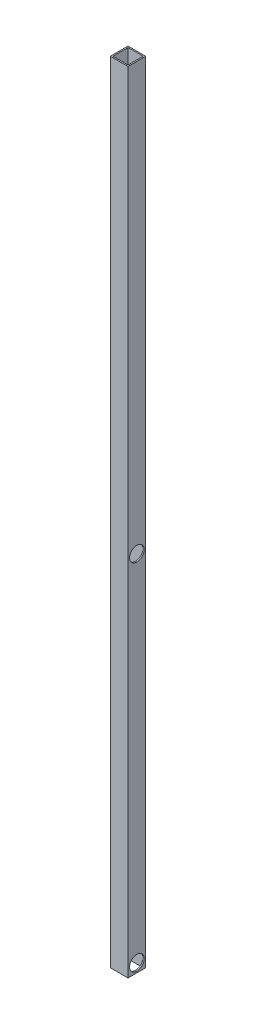
ISO-10303-21;
HEADER;
FILE_DESCRIPTION(('STEP AP214'),'2;1');
FILE_NAME('part.step','',(''),(''),'','','');
FILE_SCHEMA(('AUTOMOTIVE_DESIGN { 1 0 10303 214 1 1 1 1 }'));
ENDSEC;
DATA;
#1=APPLICATION_CONTEXT('core data for automotive mechanical design processes');
#2=APPLICATION_PROTOCOL_DEFINITION('international standard','automotive_design',2000,#1);
#3=PRODUCT_CONTEXT('',#1,'mechanical');
#4=PRODUCT('Part','Part','',(#3));
#5=PRODUCT_RELATED_PRODUCT_CATEGORY('part','',(#4));
#6=PRODUCT_DEFINITION_FORMATION('','',#4);
#7=PRODUCT_DEFINITION_CONTEXT('part definition',#1,'design');
#8=PRODUCT_DEFINITION('design','',#6,#7);
#9=PRODUCT_DEFINITION_SHAPE('','',#8);
#10=(LENGTH_UNIT() NAMED_UNIT(*) SI_UNIT(.MILLI.,.METRE.));
#11=(NAMED_UNIT(*) PLANE_ANGLE_UNIT() SI_UNIT($,.RADIAN.));
#12=(NAMED_UNIT(*) SI_UNIT($,.STERADIAN.) SOLID_ANGLE_UNIT());
#13=UNCERTAINTY_MEASURE_WITH_UNIT(LENGTH_MEASURE(1.E-05),#10,'distance_accuracy_value','');
#14=(GEOMETRIC_REPRESENTATION_CONTEXT(3) GLOBAL_UNCERTAINTY_ASSIGNED_CONTEXT((#13)) GLOBAL_UNIT_ASSIGNED_CONTEXT((#10,
#11,#12)) REPRESENTATION_CONTEXT('',''));
#15=CARTESIAN_POINT('',(0.,0.,0.));
#16=DIRECTION('',(0.,0.,1.));
#17=DIRECTION('',(1.,0.,0.));
#18=AXIS2_PLACEMENT_3D('',#15,#16,#17);
#19=CARTESIAN_POINT('',(44.45,22.225,-22.225));
#20=DIRECTION('',(1.,0.,0.));
#21=DIRECTION('',(0.,0.,-1.));
#22=AXIS2_PLACEMENT_3D('',#19,#20,#21);
#23=CYLINDRICAL_SURFACE('',#22,18.25625);
#24=CARTESIAN_POINT('',(41.275,22.225,-22.225));
#25=DIRECTION('',(1.,0.,0.));
#26=DIRECTION('',(0.,0.,-1.));
#27=AXIS2_PLACEMENT_3D('',#24,#25,#26);
#28=CIRCLE('',#27,18.25625);
#29=CARTESIAN_POINT('',(41.275,22.225,-40.48125));
#30=VERTEX_POINT('',#29);
#31=EDGE_CURVE('E20',#30,#30,#28,.T.);
#32=ORIENTED_EDGE('',*,*,#31,.F.);
#33=EDGE_LOOP('',(#32));
#34=FACE_BOUND('',#33,.T.);
#35=CARTESIAN_POINT('',(44.45,22.225,-22.225));
#36=DIRECTION('',(1.,0.,0.));
#37=DIRECTION('',(0.,0.,-1.));
#38=AXIS2_PLACEMENT_3D('',#35,#36,#37);
#39=CIRCLE('',#38,18.25625);
#40=CARTESIAN_POINT('',(44.45,22.225,-40.48125));
#41=VERTEX_POINT('',#40);
#42=EDGE_CURVE('E120',#41,#41,#39,.F.);
#43=ORIENTED_EDGE('',*,*,#42,.F.);
#44=EDGE_LOOP('',(#43));
#45=FACE_BOUND('',#44,.T.);
#46=ADVANCED_FACE('F17',(#34,#45),#23,.F.);
#47=CARTESIAN_POINT('',(44.45,911.225,-22.225));
#48=DIRECTION('',(1.,0.,0.));
#49=DIRECTION('',(0.,0.,-1.));
#50=AXIS2_PLACEMENT_3D('',#47,#48,#49);
#51=CYLINDRICAL_SURFACE('',#50,18.25625);
#52=CARTESIAN_POINT('',(41.275,911.225,-22.225));
#53=DIRECTION('',(1.,0.,0.));
#54=DIRECTION('',(0.,0.,-1.));
#55=AXIS2_PLACEMENT_3D('',#52,#53,#54);
#56=CIRCLE('',#55,18.25625);
#57=CARTESIAN_POINT('',(41.275,911.225,-40.48125));
#58=VERTEX_POINT('',#57);
#59=EDGE_CURVE('E126',#58,#58,#56,.T.);
#60=ORIENTED_EDGE('',*,*,#59,.F.);
#61=EDGE_LOOP('',(#60));
#62=FACE_BOUND('',#61,.T.);
#63=CARTESIAN_POINT('',(44.45,911.225,-22.225));
#64=DIRECTION('',(1.,0.,0.));
#65=DIRECTION('',(0.,0.,-1.));
#66=AXIS2_PLACEMENT_3D('',#63,#64,#65);
#67=CIRCLE('',#66,18.25625);
#68=CARTESIAN_POINT('',(44.45,911.225,-40.48125));
#69=VERTEX_POINT('',#68);
#70=EDGE_CURVE('E116',#69,#69,#67,.F.);
#71=ORIENTED_EDGE('',*,*,#70,.F.);
#72=EDGE_LOOP('',(#71));
#73=FACE_BOUND('',#72,.T.);
#74=ADVANCED_FACE('F153',(#62,#73),#51,.F.);
#75=CARTESIAN_POINT('',(44.45,911.225,-22.225));
#76=DIRECTION('',(1.,0.,0.));
#77=DIRECTION('',(0.,0.,-1.));
#78=AXIS2_PLACEMENT_3D('',#75,#76,#77);
#79=CYLINDRICAL_SURFACE('',#78,12.7);
#80=CARTESIAN_POINT('',(3.175,911.225,-22.225));
#81=DIRECTION('',(1.,0.,0.));
#82=DIRECTION('',(0.,0.,-1.));
#83=AXIS2_PLACEMENT_3D('',#80,#81,#82);
#84=CIRCLE('',#83,12.7);
#85=CARTESIAN_POINT('',(3.175,911.225,-34.925));
#86=VERTEX_POINT('',#85);
#87=EDGE_CURVE('E91',#86,#86,#84,.F.);
#88=ORIENTED_EDGE('',*,*,#87,.F.);
#89=EDGE_LOOP('',(#88));
#90=FACE_BOUND('',#89,.T.);
#91=CARTESIAN_POINT('',(0.,911.225,-22.225));
#92=DIRECTION('',(1.,0.,0.));
#93=DIRECTION('',(0.,0.,-1.));
#94=AXIS2_PLACEMENT_3D('',#91,#92,#93);
#95=CIRCLE('',#94,12.7);
#96=CARTESIAN_POINT('',(0.,911.225,-34.925));
#97=VERTEX_POINT('',#96);
#98=EDGE_CURVE('E131',#97,#97,#95,.T.);
#99=ORIENTED_EDGE('',*,*,#98,.F.);
#100=EDGE_LOOP('',(#99));
#101=FACE_BOUND('',#100,.T.);
#102=ADVANCED_FACE('F229',(#90,#101),#79,.F.);
#103=CARTESIAN_POINT('',(44.45,22.225,-22.225));
#104=DIRECTION('',(1.,0.,0.));
#105=DIRECTION('',(0.,0.,-1.));
#106=AXIS2_PLACEMENT_3D('',#103,#104,#105);
#107=CYLINDRICAL_SURFACE('',#106,12.7);
#108=CARTESIAN_POINT('',(3.175,22.225,-22.225));
#109=DIRECTION('',(1.,0.,0.));
#110=DIRECTION('',(0.,0.,-1.));
#111=AXIS2_PLACEMENT_3D('',#108,#109,#110);
#112=CIRCLE('',#111,12.7);
#113=CARTESIAN_POINT('',(3.175,22.225,-34.925));
#114=VERTEX_POINT('',#113);
#115=EDGE_CURVE('E123',#114,#114,#112,.F.);
#116=ORIENTED_EDGE('',*,*,#115,.F.);
#117=EDGE_LOOP('',(#116));
#118=FACE_BOUND('',#117,.T.);
#119=CARTESIAN_POINT('',(0.,22.225,-22.225));
#120=DIRECTION('',(1.,0.,0.));
#121=DIRECTION('',(0.,0.,-1.));
#122=AXIS2_PLACEMENT_3D('',#119,#120,#121);
#123=CIRCLE('',#122,12.7);
#124=CARTESIAN_POINT('',(0.,22.225,-34.925));
#125=VERTEX_POINT('',#124);
#126=EDGE_CURVE('E127',#125,#125,#123,.T.);
#127=ORIENTED_EDGE('',*,*,#126,.F.);
#128=EDGE_LOOP('',(#127));
#129=FACE_BOUND('',#128,.T.);
#130=ADVANCED_FACE('F225',(#118,#129),#107,.F.);
#131=CARTESIAN_POINT('',(44.45,0.,-44.45));
#132=DIRECTION('',(0.,0.,-1.));
#133=DIRECTION('',(-1.,0.,0.));
#134=AXIS2_PLACEMENT_3D('',#131,#132,#133);
#135=PLANE('',#134);
#136=DIRECTION('',(0.,1.,0.));
#137=VECTOR('',#136,1.);
#138=CARTESIAN_POINT('',(44.45,0.,-44.45));
#139=LINE('',#138,#137);
#140=CARTESIAN_POINT('',(44.45,0.,-44.45));
#141=VERTEX_POINT('',#140);
#142=CARTESIAN_POINT('',(44.45,1981.2,-44.45));
#143=VERTEX_POINT('',#142);
#144=EDGE_CURVE('E117',#141,#143,#139,.T.);
#145=ORIENTED_EDGE('',*,*,#144,.F.);
#146=DIRECTION('',(1.,0.,0.));
#147=VECTOR('',#146,1.);
#148=CARTESIAN_POINT('',(0.,0.,-44.45));
#149=LINE('',#148,#147);
#150=CARTESIAN_POINT('',(0.,0.,-44.45));
#151=VERTEX_POINT('',#150);
#152=EDGE_CURVE('E176',#141,#151,#149,.F.);
#153=ORIENTED_EDGE('',*,*,#152,.T.);
#154=DIRECTION('',(0.,1.,0.));
#155=VECTOR('',#154,1.);
#156=CARTESIAN_POINT('',(0.,0.,-44.45));
#157=LINE('',#156,#155);
#158=CARTESIAN_POINT('',(0.,1981.2,-44.45));
#159=VERTEX_POINT('',#158);
#160=EDGE_CURVE('E134',#159,#151,#157,.F.);
#161=ORIENTED_EDGE('',*,*,#160,.F.);
#162=DIRECTION('',(1.,0.,0.));
#163=VECTOR('',#162,1.);
#164=CARTESIAN_POINT('',(0.,1981.2,-44.45));
#165=LINE('',#164,#163);
#166=EDGE_CURVE('E108',#143,#159,#165,.F.);
#167=ORIENTED_EDGE('',*,*,#166,.F.);
#168=EDGE_LOOP('',(#145,#153,#161,#167));
#169=FACE_BOUND('',#168,.T.);
#170=ADVANCED_FACE('F222',(#169),#135,.T.);
#171=CARTESIAN_POINT('',(41.275,0.,-41.275));
#172=DIRECTION('',(-1.,0.,0.));
#173=DIRECTION('',(0.,0.,1.));
#174=AXIS2_PLACEMENT_3D('',#171,#172,#173);
#175=PLANE('',#174);
#176=ORIENTED_EDGE('',*,*,#59,.T.);
#177=EDGE_LOOP('',(#176));
#178=FACE_BOUND('',#177,.T.);
#179=ORIENTED_EDGE('',*,*,#31,.T.);
#180=EDGE_LOOP('',(#179));
#181=FACE_BOUND('',#180,.T.);
#182=DIRECTION('',(0.,1.,0.));
#183=VECTOR('',#182,1.);
#184=CARTESIAN_POINT('',(41.275,0.,-41.275));
#185=LINE('',#184,#183);
#186=CARTESIAN_POINT('',(41.275,0.,-41.275));
#187=VERTEX_POINT('',#186);
#188=CARTESIAN_POINT('',(41.275,1981.2,-41.275));
#189=VERTEX_POINT('',#188);
#190=EDGE_CURVE('E122',#187,#189,#185,.T.);
#191=ORIENTED_EDGE('',*,*,#190,.F.);
#192=DIRECTION('',(0.,0.,1.));
#193=VECTOR('',#192,1.);
#194=CARTESIAN_POINT('',(41.275,0.,0.));
#195=LINE('',#194,#193);
#196=CARTESIAN_POINT('',(41.275,0.,-3.175));
#197=VERTEX_POINT('',#196);
#198=EDGE_CURVE('E188',#187,#197,#195,.T.);
#199=ORIENTED_EDGE('',*,*,#198,.T.);
#200=DIRECTION('',(0.,1.,0.));
#201=VECTOR('',#200,1.);
#202=CARTESIAN_POINT('',(41.275,0.,-3.175));
#203=LINE('',#202,#201);
#204=CARTESIAN_POINT('',(41.275,1981.2,-3.175));
#205=VERTEX_POINT('',#204);
#206=EDGE_CURVE('E92',#205,#197,#203,.F.);
#207=ORIENTED_EDGE('',*,*,#206,.F.);
#208=DIRECTION('',(0.,0.,1.));
#209=VECTOR('',#208,1.);
#210=CARTESIAN_POINT('',(41.275,1981.2,0.));
#211=LINE('',#210,#209);
#212=EDGE_CURVE('E107',#189,#205,#211,.T.);
#213=ORIENTED_EDGE('',*,*,#212,.F.);
#214=EDGE_LOOP('',(#191,#199,#207,#213));
#215=FACE_BOUND('',#214,.T.);
#216=ADVANCED_FACE('F148',(#178,#181,#215),#175,.T.);
#217=CARTESIAN_POINT('',(41.275,0.,-3.175));
#218=DIRECTION('',(0.,0.,-1.));
#219=DIRECTION('',(-1.,0.,0.));
#220=AXIS2_PLACEMENT_3D('',#217,#218,#219);
#221=PLANE('',#220);
#222=ORIENTED_EDGE('',*,*,#206,.T.);
#223=DIRECTION('',(1.,0.,0.));
#224=VECTOR('',#223,1.);
#225=CARTESIAN_POINT('',(0.,0.,-3.175));
#226=LINE('',#225,#224);
#227=CARTESIAN_POINT('',(3.175,0.,-3.175));
#228=VERTEX_POINT('',#227);
#229=EDGE_CURVE('E88',#197,#228,#226,.F.);
#230=ORIENTED_EDGE('',*,*,#229,.T.);
#231=DIRECTION('',(0.,1.,0.));
#232=VECTOR('',#231,1.);
#233=CARTESIAN_POINT('',(3.175,0.,-3.175));
#234=LINE('',#233,#232);
#235=CARTESIAN_POINT('',(3.175,1981.2,-3.175));
#236=VERTEX_POINT('',#235);
#237=EDGE_CURVE('E80',#236,#228,#234,.F.);
#238=ORIENTED_EDGE('',*,*,#237,.F.);
#239=DIRECTION('',(1.,0.,0.));
#240=VECTOR('',#239,1.);
#241=CARTESIAN_POINT('',(0.,1981.2,-3.175));
#242=LINE('',#241,#240);
#243=EDGE_CURVE('E85',#205,#236,#242,.F.);
#244=ORIENTED_EDGE('',*,*,#243,.F.);
#245=EDGE_LOOP('',(#222,#230,#238,#244));
#246=FACE_BOUND('',#245,.T.);
#247=ADVANCED_FACE('F83',(#246),#221,.T.);
#248=CARTESIAN_POINT('',(3.175,0.,-3.175));
#249=DIRECTION('',(1.,0.,0.));
#250=DIRECTION('',(0.,0.,-1.));
#251=AXIS2_PLACEMENT_3D('',#248,#249,#250);
#252=PLANE('',#251);
#253=ORIENTED_EDGE('',*,*,#115,.T.);
#254=EDGE_LOOP('',(#253));
#255=FACE_BOUND('',#254,.T.);
#256=ORIENTED_EDGE('',*,*,#87,.T.);
#257=EDGE_LOOP('',(#256));
#258=FACE_BOUND('',#257,.T.);
#259=ORIENTED_EDGE('',*,*,#237,.T.);
#260=DIRECTION('',(0.,0.,1.));
#261=VECTOR('',#260,1.);
#262=CARTESIAN_POINT('',(3.175,0.,0.));
#263=LINE('',#262,#261);
#264=CARTESIAN_POINT('',(3.175,0.,-41.275));
#265=VERTEX_POINT('',#264);
#266=EDGE_CURVE('E185',#228,#265,#263,.F.);
#267=ORIENTED_EDGE('',*,*,#266,.T.);
#268=DIRECTION('',(0.,1.,0.));
#269=VECTOR('',#268,1.);
#270=CARTESIAN_POINT('',(3.175,0.,-41.275));
#271=LINE('',#270,#269);
#272=CARTESIAN_POINT('',(3.175,1981.2,-41.275));
#273=VERTEX_POINT('',#272);
#274=EDGE_CURVE('E98',#273,#265,#271,.F.);
#275=ORIENTED_EDGE('',*,*,#274,.F.);
#276=DIRECTION('',(0.,0.,1.));
#277=VECTOR('',#276,1.);
#278=CARTESIAN_POINT('',(3.175,1981.2,0.));
#279=LINE('',#278,#277);
#280=EDGE_CURVE('E95',#236,#273,#279,.F.);
#281=ORIENTED_EDGE('',*,*,#280,.F.);
#282=EDGE_LOOP('',(#259,#267,#275,#281));
#283=FACE_BOUND('',#282,.T.);
#284=ADVANCED_FACE('F96',(#255,#258,#283),#252,.T.);
#285=CARTESIAN_POINT('',(3.175,0.,-41.275));
#286=DIRECTION('',(0.,0.,1.));
#287=DIRECTION('',(1.,0.,0.));
#288=AXIS2_PLACEMENT_3D('',#285,#286,#287);
#289=PLANE('',#288);
#290=ORIENTED_EDGE('',*,*,#274,.T.);
#291=DIRECTION('',(1.,0.,0.));
#292=VECTOR('',#291,1.);
#293=CARTESIAN_POINT('',(0.,0.,-41.275));
#294=LINE('',#293,#292);
#295=EDGE_CURVE('E171',#265,#187,#294,.T.);
#296=ORIENTED_EDGE('',*,*,#295,.T.);
#297=ORIENTED_EDGE('',*,*,#190,.T.);
#298=DIRECTION('',(1.,0.,0.));
#299=VECTOR('',#298,1.);
#300=CARTESIAN_POINT('',(0.,1981.2,-41.275));
#301=LINE('',#300,#299);
#302=EDGE_CURVE('E102',#273,#189,#301,.T.);
#303=ORIENTED_EDGE('',*,*,#302,.F.);
#304=EDGE_LOOP('',(#290,#296,#297,#303));
#305=FACE_BOUND('',#304,.T.);
#306=ADVANCED_FACE('F159',(#305),#289,.T.);
#307=CARTESIAN_POINT('',(44.45,0.,0.));
#308=DIRECTION('',(1.,0.,0.));
#309=DIRECTION('',(0.,0.,-1.));
#310=AXIS2_PLACEMENT_3D('',#307,#308,#309);
#311=PLANE('',#310);
#312=ORIENTED_EDGE('',*,*,#70,.T.);
#313=EDGE_LOOP('',(#312));
#314=FACE_BOUND('',#313,.T.);
#315=ORIENTED_EDGE('',*,*,#42,.T.);
#316=EDGE_LOOP('',(#315));
#317=FACE_BOUND('',#316,.T.);
#318=DIRECTION('',(0.,1.,0.));
#319=VECTOR('',#318,1.);
#320=CARTESIAN_POINT('',(44.45,0.,0.));
#321=LINE('',#320,#319);
#322=CARTESIAN_POINT('',(44.45,0.,0.));
#323=VERTEX_POINT('',#322);
#324=CARTESIAN_POINT('',(44.45,1981.2,0.));
#325=VERTEX_POINT('',#324);
#326=EDGE_CURVE('E164',#323,#325,#321,.T.);
#327=ORIENTED_EDGE('',*,*,#326,.F.);
#328=DIRECTION('',(0.,0.,1.));
#329=VECTOR('',#328,1.);
#330=CARTESIAN_POINT('',(44.45,0.,0.));
#331=LINE('',#330,#329);
#332=EDGE_CURVE('E130',#323,#141,#331,.F.);
#333=ORIENTED_EDGE('',*,*,#332,.T.);
#334=ORIENTED_EDGE('',*,*,#144,.T.);
#335=DIRECTION('',(0.,0.,1.));
#336=VECTOR('',#335,1.);
#337=CARTESIAN_POINT('',(44.45,1981.2,0.));
#338=LINE('',#337,#336);
#339=EDGE_CURVE('E110',#325,#143,#338,.F.);
#340=ORIENTED_EDGE('',*,*,#339,.F.);
#341=EDGE_LOOP('',(#327,#333,#334,#340));
#342=FACE_BOUND('',#341,.T.);
#343=ADVANCED_FACE('F156',(#314,#317,#342),#311,.T.);
#344=CARTESIAN_POINT('',(0.,1981.2,0.));
#345=DIRECTION('',(0.,1.,0.));
#346=DIRECTION('',(0.,0.,1.));
#347=AXIS2_PLACEMENT_3D('',#344,#345,#346);
#348=PLANE('',#347);
#349=ORIENTED_EDGE('',*,*,#302,.T.);
#350=ORIENTED_EDGE('',*,*,#212,.T.);
#351=ORIENTED_EDGE('',*,*,#243,.T.);
#352=ORIENTED_EDGE('',*,*,#280,.T.);
#353=EDGE_LOOP('',(#349,#350,#351,#352));
#354=FACE_BOUND('',#353,.T.);
#355=DIRECTION('',(0.,0.,1.));
#356=VECTOR('',#355,1.);
#357=CARTESIAN_POINT('',(0.,1981.2,-44.45));
#358=LINE('',#357,#356);
#359=CARTESIAN_POINT('',(0.,1981.2,0.));
#360=VERTEX_POINT('',#359);
#361=EDGE_CURVE('E193',#360,#159,#358,.F.);
#362=ORIENTED_EDGE('',*,*,#361,.F.);
#363=DIRECTION('',(1.,0.,0.));
#364=VECTOR('',#363,1.);
#365=CARTESIAN_POINT('',(0.,1981.2,0.));
#366=LINE('',#365,#364);
#367=EDGE_CURVE('E170',#325,#360,#366,.F.);
#368=ORIENTED_EDGE('',*,*,#367,.F.);
#369=ORIENTED_EDGE('',*,*,#339,.T.);
#370=ORIENTED_EDGE('',*,*,#166,.T.);
#371=EDGE_LOOP('',(#362,#368,#369,#370));
#372=FACE_BOUND('',#371,.T.);
#373=ADVANCED_FACE('F104',(#354,#372),#348,.T.);
#374=CARTESIAN_POINT('',(0.,0.,-44.45));
#375=DIRECTION('',(-1.,0.,0.));
#376=DIRECTION('',(0.,0.,1.));
#377=AXIS2_PLACEMENT_3D('',#374,#375,#376);
#378=PLANE('',#377);
#379=ORIENTED_EDGE('',*,*,#126,.T.);
#380=EDGE_LOOP('',(#379));
#381=FACE_BOUND('',#380,.T.);
#382=ORIENTED_EDGE('',*,*,#98,.T.);
#383=EDGE_LOOP('',(#382));
#384=FACE_BOUND('',#383,.T.);
#385=ORIENTED_EDGE('',*,*,#160,.T.);
#386=DIRECTION('',(0.,0.,1.));
#387=VECTOR('',#386,1.);
#388=CARTESIAN_POINT('',(0.,0.,0.));
#389=LINE('',#388,#387);
#390=CARTESIAN_POINT('',(0.,0.,0.));
#391=VERTEX_POINT('',#390);
#392=EDGE_CURVE('E35',#151,#391,#389,.T.);
#393=ORIENTED_EDGE('',*,*,#392,.T.);
#394=DIRECTION('',(0.,1.,0.));
#395=VECTOR('',#394,1.);
#396=CARTESIAN_POINT('',(0.,0.,0.));
#397=LINE('',#396,#395);
#398=EDGE_CURVE('E26',#360,#391,#397,.F.);
#399=ORIENTED_EDGE('',*,*,#398,.F.);
#400=ORIENTED_EDGE('',*,*,#361,.T.);
#401=EDGE_LOOP('',(#385,#393,#399,#400));
#402=FACE_BOUND('',#401,.T.);
#403=ADVANCED_FACE('F200',(#381,#384,#402),#378,.T.);
#404=CARTESIAN_POINT('',(0.,0.,0.));
#405=DIRECTION('',(0.,1.,0.));
#406=DIRECTION('',(0.,0.,1.));
#407=AXIS2_PLACEMENT_3D('',#404,#405,#406);
#408=PLANE('',#407);
#409=ORIENTED_EDGE('',*,*,#266,.F.);
#410=ORIENTED_EDGE('',*,*,#229,.F.);
#411=ORIENTED_EDGE('',*,*,#198,.F.);
#412=ORIENTED_EDGE('',*,*,#295,.F.);
#413=EDGE_LOOP('',(#409,#410,#411,#412));
#414=FACE_BOUND('',#413,.T.);
#415=ORIENTED_EDGE('',*,*,#152,.F.);
#416=ORIENTED_EDGE('',*,*,#332,.F.);
#417=DIRECTION('',(1.,0.,0.));
#418=VECTOR('',#417,1.);
#419=CARTESIAN_POINT('',(0.,0.,0.));
#420=LINE('',#419,#418);
#421=EDGE_CURVE('E11',#391,#323,#420,.T.);
#422=ORIENTED_EDGE('',*,*,#421,.F.);
#423=ORIENTED_EDGE('',*,*,#392,.F.);
#424=EDGE_LOOP('',(#415,#416,#422,#423));
#425=FACE_BOUND('',#424,.T.);
#426=ADVANCED_FACE('F174',(#414,#425),#408,.F.);
#427=CARTESIAN_POINT('',(0.,0.,0.));
#428=DIRECTION('',(0.,0.,1.));
#429=DIRECTION('',(1.,0.,0.));
#430=AXIS2_PLACEMENT_3D('',#427,#428,#429);
#431=PLANE('',#430);
#432=ORIENTED_EDGE('',*,*,#398,.T.);
#433=ORIENTED_EDGE('',*,*,#421,.T.);
#434=ORIENTED_EDGE('',*,*,#326,.T.);
#435=ORIENTED_EDGE('',*,*,#367,.T.);
#436=EDGE_LOOP('',(#432,#433,#434,#435));
#437=FACE_BOUND('',#436,.T.);
#438=ADVANCED_FACE('F178',(#437),#431,.T.);
#439=CLOSED_SHELL('',(#46,#74,#102,#130,#170,#216,#247,#284,#306,#343,#373,#403,#426,#438));
#440=MANIFOLD_SOLID_BREP('B1',#439);
#441=ADVANCED_BREP_SHAPE_REPRESENTATION('',(#18,#440),#14);
#442=SHAPE_DEFINITION_REPRESENTATION(#9,#441);
ENDSEC;
END-ISO-10303-21;
